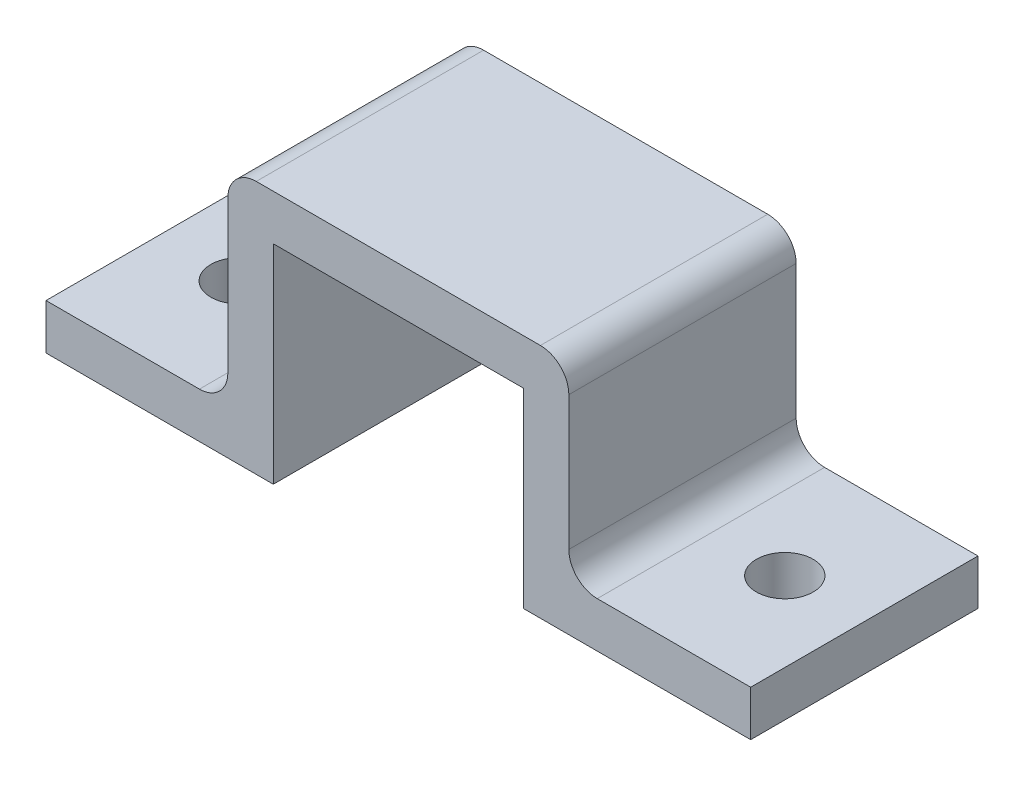
ISO-10303-21;
HEADER;
FILE_DESCRIPTION(('STEP AP214'),'2;1');
FILE_NAME('part.step','',(''),(''),'','','');
FILE_SCHEMA(('AUTOMOTIVE_DESIGN { 1 0 10303 214 1 1 1 1 }'));
ENDSEC;
DATA;
#1=APPLICATION_CONTEXT('core data for automotive mechanical design processes');
#2=APPLICATION_PROTOCOL_DEFINITION('international standard','automotive_design',2000,#1);
#3=PRODUCT_CONTEXT('',#1,'mechanical');
#4=PRODUCT('Part','Part','',(#3));
#5=PRODUCT_RELATED_PRODUCT_CATEGORY('part','',(#4));
#6=PRODUCT_DEFINITION_FORMATION('','',#4);
#7=PRODUCT_DEFINITION_CONTEXT('part definition',#1,'design');
#8=PRODUCT_DEFINITION('design','',#6,#7);
#9=PRODUCT_DEFINITION_SHAPE('','',#8);
#10=(LENGTH_UNIT() NAMED_UNIT(*) SI_UNIT(.MILLI.,.METRE.));
#11=(NAMED_UNIT(*) PLANE_ANGLE_UNIT() SI_UNIT($,.RADIAN.));
#12=(NAMED_UNIT(*) SI_UNIT($,.STERADIAN.) SOLID_ANGLE_UNIT());
#13=UNCERTAINTY_MEASURE_WITH_UNIT(LENGTH_MEASURE(1.E-05),#10,'distance_accuracy_value','');
#14=(GEOMETRIC_REPRESENTATION_CONTEXT(3) GLOBAL_UNCERTAINTY_ASSIGNED_CONTEXT((#13)) GLOBAL_UNIT_ASSIGNED_CONTEXT((#10,
#11,#12)) REPRESENTATION_CONTEXT('',''));
#15=CARTESIAN_POINT('',(0.,0.,0.));
#16=DIRECTION('',(0.,0.,1.));
#17=DIRECTION('',(1.,0.,0.));
#18=AXIS2_PLACEMENT_3D('',#15,#16,#17);
#19=CARTESIAN_POINT('',(0.,4.,20.));
#20=DIRECTION('',(1.,0.,0.));
#21=DIRECTION('',(0.,1.,0.));
#22=AXIS2_PLACEMENT_3D('',#19,#20,#21);
#23=PLANE('',#22);
#24=DIRECTION('',(0.,-1.,0.));
#25=VECTOR('',#24,1.);
#26=CARTESIAN_POINT('',(0.,4.,0.));
#27=LINE('',#26,#25);
#28=CARTESIAN_POINT('',(0.,4.,0.));
#29=VERTEX_POINT('',#28);
#30=CARTESIAN_POINT('',(0.,0.,0.));
#31=VERTEX_POINT('',#30);
#32=EDGE_CURVE('E168',#29,#31,#27,.T.);
#33=ORIENTED_EDGE('',*,*,#32,.T.);
#34=DIRECTION('',(0.,0.,-1.));
#35=VECTOR('',#34,1.);
#36=CARTESIAN_POINT('',(0.,0.,20.));
#37=LINE('',#36,#35);
#38=CARTESIAN_POINT('',(0.,0.,20.));
#39=VERTEX_POINT('',#38);
#40=EDGE_CURVE('E150',#39,#31,#37,.T.);
#41=ORIENTED_EDGE('',*,*,#40,.F.);
#42=DIRECTION('',(0.,-1.,0.));
#43=VECTOR('',#42,1.);
#44=CARTESIAN_POINT('',(0.,4.,20.));
#45=LINE('',#44,#43);
#46=CARTESIAN_POINT('',(0.,4.,20.));
#47=VERTEX_POINT('',#46);
#48=EDGE_CURVE('E156',#47,#39,#45,.T.);
#49=ORIENTED_EDGE('',*,*,#48,.F.);
#50=DIRECTION('',(0.,0.,-1.));
#51=VECTOR('',#50,1.);
#52=CARTESIAN_POINT('',(0.,4.,20.));
#53=LINE('',#52,#51);
#54=EDGE_CURVE('E218',#47,#29,#53,.T.);
#55=ORIENTED_EDGE('',*,*,#54,.T.);
#56=EDGE_LOOP('',(#33,#41,#49,#55));
#57=FACE_BOUND('',#56,.T.);
#58=ADVANCED_FACE('F33',(#57),#23,.F.);
#59=CARTESIAN_POINT('',(0.,0.,20.));
#60=DIRECTION('',(0.,1.,0.));
#61=DIRECTION('',(0.,0.,1.));
#62=AXIS2_PLACEMENT_3D('',#59,#60,#61);
#63=PLANE('',#62);
#64=CARTESIAN_POINT('',(7.,0.,10.));
#65=DIRECTION('',(0.,1.,0.));
#66=DIRECTION('',(0.,0.,1.));
#67=AXIS2_PLACEMENT_3D('',#64,#65,#66);
#68=CIRCLE('',#67,2.5);
#69=CARTESIAN_POINT('',(7.,0.,12.5));
#70=VERTEX_POINT('',#69);
#71=EDGE_CURVE('E229',#70,#70,#68,.T.);
#72=ORIENTED_EDGE('',*,*,#71,.T.);
#73=EDGE_LOOP('',(#72));
#74=FACE_BOUND('',#73,.T.);
#75=DIRECTION('',(1.,0.,0.));
#76=VECTOR('',#75,1.);
#77=CARTESIAN_POINT('',(0.,0.,0.));
#78=LINE('',#77,#76);
#79=CARTESIAN_POINT('',(20.,0.,0.));
#80=VERTEX_POINT('',#79);
#81=EDGE_CURVE('E228',#31,#80,#78,.T.);
#82=ORIENTED_EDGE('',*,*,#81,.T.);
#83=DIRECTION('',(0.,0.,-1.));
#84=VECTOR('',#83,1.);
#85=CARTESIAN_POINT('',(20.,0.,20.));
#86=LINE('',#85,#84);
#87=CARTESIAN_POINT('',(20.,0.,20.));
#88=VERTEX_POINT('',#87);
#89=EDGE_CURVE('E153',#88,#80,#86,.T.);
#90=ORIENTED_EDGE('',*,*,#89,.F.);
#91=DIRECTION('',(1.,0.,0.));
#92=VECTOR('',#91,1.);
#93=CARTESIAN_POINT('',(0.,0.,20.));
#94=LINE('',#93,#92);
#95=EDGE_CURVE('E146',#39,#88,#94,.T.);
#96=ORIENTED_EDGE('',*,*,#95,.F.);
#97=ORIENTED_EDGE('',*,*,#40,.T.);
#98=EDGE_LOOP('',(#82,#90,#96,#97));
#99=FACE_BOUND('',#98,.T.);
#100=ADVANCED_FACE('F148',(#74,#99),#63,.F.);
#101=CARTESIAN_POINT('',(20.,0.,20.));
#102=DIRECTION('',(-1.,0.,0.));
#103=DIRECTION('',(0.,0.,1.));
#104=AXIS2_PLACEMENT_3D('',#101,#102,#103);
#105=PLANE('',#104);
#106=DIRECTION('',(0.,1.,0.));
#107=VECTOR('',#106,1.);
#108=CARTESIAN_POINT('',(20.,0.,0.));
#109=LINE('',#108,#107);
#110=CARTESIAN_POINT('',(20.,18.325792173001,0.));
#111=VERTEX_POINT('',#110);
#112=EDGE_CURVE('E231',#80,#111,#109,.T.);
#113=ORIENTED_EDGE('',*,*,#112,.T.);
#114=DIRECTION('',(0.,0.,-1.));
#115=VECTOR('',#114,1.);
#116=CARTESIAN_POINT('',(20.,18.325792173001,20.));
#117=LINE('',#116,#115);
#118=CARTESIAN_POINT('',(20.,18.325792173001,20.));
#119=VERTEX_POINT('',#118);
#120=EDGE_CURVE('E173',#119,#111,#117,.T.);
#121=ORIENTED_EDGE('',*,*,#120,.F.);
#122=DIRECTION('',(0.,1.,0.));
#123=VECTOR('',#122,1.);
#124=CARTESIAN_POINT('',(20.,0.,20.));
#125=LINE('',#124,#123);
#126=EDGE_CURVE('E155',#88,#119,#125,.T.);
#127=ORIENTED_EDGE('',*,*,#126,.F.);
#128=ORIENTED_EDGE('',*,*,#89,.T.);
#129=EDGE_LOOP('',(#113,#121,#127,#128));
#130=FACE_BOUND('',#129,.T.);
#131=ADVANCED_FACE('F341',(#130),#105,.F.);
#132=CARTESIAN_POINT('',(20.,18.325792173001,20.));
#133=DIRECTION('',(0.,1.,0.));
#134=DIRECTION('',(0.,0.,1.));
#135=AXIS2_PLACEMENT_3D('',#132,#133,#134);
#136=PLANE('',#135);
#137=DIRECTION('',(1.,0.,0.));
#138=VECTOR('',#137,1.);
#139=CARTESIAN_POINT('',(20.,18.325792173001,0.));
#140=LINE('',#139,#138);
#141=CARTESIAN_POINT('',(42.,18.325792173001,0.));
#142=VERTEX_POINT('',#141);
#143=EDGE_CURVE('E233',#111,#142,#140,.T.);
#144=ORIENTED_EDGE('',*,*,#143,.T.);
#145=DIRECTION('',(0.,0.,-1.));
#146=VECTOR('',#145,1.);
#147=CARTESIAN_POINT('',(42.,18.325792173001,20.));
#148=LINE('',#147,#146);
#149=CARTESIAN_POINT('',(42.,18.325792173001,20.));
#150=VERTEX_POINT('',#149);
#151=EDGE_CURVE('E258',#150,#142,#148,.T.);
#152=ORIENTED_EDGE('',*,*,#151,.F.);
#153=DIRECTION('',(1.,0.,0.));
#154=VECTOR('',#153,1.);
#155=CARTESIAN_POINT('',(20.,18.325792173001,20.));
#156=LINE('',#155,#154);
#157=EDGE_CURVE('E267',#119,#150,#156,.T.);
#158=ORIENTED_EDGE('',*,*,#157,.F.);
#159=ORIENTED_EDGE('',*,*,#120,.T.);
#160=EDGE_LOOP('',(#144,#152,#158,#159));
#161=FACE_BOUND('',#160,.T.);
#162=ADVANCED_FACE('F265',(#161),#136,.F.);
#163=CARTESIAN_POINT('',(42.,18.325792173001,20.));
#164=DIRECTION('',(1.,0.,0.));
#165=DIRECTION('',(0.,1.,0.));
#166=AXIS2_PLACEMENT_3D('',#163,#164,#165);
#167=PLANE('',#166);
#168=DIRECTION('',(0.,-1.,0.));
#169=VECTOR('',#168,1.);
#170=CARTESIAN_POINT('',(42.,18.325792173001,0.));
#171=LINE('',#170,#169);
#172=CARTESIAN_POINT('',(42.,1.53631848879043,0.));
#173=VERTEX_POINT('',#172);
#174=EDGE_CURVE('E235',#142,#173,#171,.T.);
#175=ORIENTED_EDGE('',*,*,#174,.T.);
#176=DIRECTION('',(0.,0.,-1.));
#177=VECTOR('',#176,1.);
#178=CARTESIAN_POINT('',(42.,1.53631848879043,20.));
#179=LINE('',#178,#177);
#180=CARTESIAN_POINT('',(42.,1.53631848879043,20.));
#181=VERTEX_POINT('',#180);
#182=EDGE_CURVE('E255',#181,#173,#179,.T.);
#183=ORIENTED_EDGE('',*,*,#182,.F.);
#184=DIRECTION('',(0.,-1.,0.));
#185=VECTOR('',#184,1.);
#186=CARTESIAN_POINT('',(42.,18.325792173001,20.));
#187=LINE('',#186,#185);
#188=EDGE_CURVE('E284',#150,#181,#187,.T.);
#189=ORIENTED_EDGE('',*,*,#188,.F.);
#190=ORIENTED_EDGE('',*,*,#151,.T.);
#191=EDGE_LOOP('',(#175,#183,#189,#190));
#192=FACE_BOUND('',#191,.T.);
#193=ADVANCED_FACE('F275',(#192),#167,.F.);
#194=CARTESIAN_POINT('',(42.,1.53631848879043,20.));
#195=DIRECTION('',(0.,1.,0.));
#196=DIRECTION('',(-1.,0.,0.));
#197=AXIS2_PLACEMENT_3D('',#194,#195,#196);
#198=PLANE('',#197);
#199=CARTESIAN_POINT('',(55.,1.53631848879043,10.));
#200=DIRECTION('',(0.,1.,0.));
#201=DIRECTION('',(-1.,0.,0.));
#202=AXIS2_PLACEMENT_3D('',#199,#200,#201);
#203=CIRCLE('',#202,2.5);
#204=CARTESIAN_POINT('',(52.5,1.53631848879043,10.));
#205=VERTEX_POINT('',#204);
#206=EDGE_CURVE('E492',#205,#205,#203,.T.);
#207=ORIENTED_EDGE('',*,*,#206,.T.);
#208=EDGE_LOOP('',(#207));
#209=FACE_BOUND('',#208,.T.);
#210=DIRECTION('',(1.,0.,0.));
#211=VECTOR('',#210,1.);
#212=CARTESIAN_POINT('',(42.,1.53631848879043,0.));
#213=LINE('',#212,#211);
#214=CARTESIAN_POINT('',(62.,1.53631848879043,0.));
#215=VERTEX_POINT('',#214);
#216=EDGE_CURVE('E237',#173,#215,#213,.T.);
#217=ORIENTED_EDGE('',*,*,#216,.T.);
#218=DIRECTION('',(0.,0.,-1.));
#219=VECTOR('',#218,1.);
#220=CARTESIAN_POINT('',(62.,1.53631848879043,20.));
#221=LINE('',#220,#219);
#222=CARTESIAN_POINT('',(62.,1.53631848879043,20.));
#223=VERTEX_POINT('',#222);
#224=EDGE_CURVE('E252',#223,#215,#221,.T.);
#225=ORIENTED_EDGE('',*,*,#224,.F.);
#226=DIRECTION('',(1.,0.,0.));
#227=VECTOR('',#226,1.);
#228=CARTESIAN_POINT('',(42.,1.53631848879043,20.));
#229=LINE('',#228,#227);
#230=EDGE_CURVE('E281',#181,#223,#229,.T.);
#231=ORIENTED_EDGE('',*,*,#230,.F.);
#232=ORIENTED_EDGE('',*,*,#182,.T.);
#233=EDGE_LOOP('',(#217,#225,#231,#232));
#234=FACE_BOUND('',#233,.T.);
#235=ADVANCED_FACE('F279',(#209,#234),#198,.F.);
#236=CARTESIAN_POINT('',(62.,1.53631848879043,20.));
#237=DIRECTION('',(-1.,0.,0.));
#238=DIRECTION('',(0.,0.,1.));
#239=AXIS2_PLACEMENT_3D('',#236,#237,#238);
#240=PLANE('',#239);
#241=DIRECTION('',(0.,1.,0.));
#242=VECTOR('',#241,1.);
#243=CARTESIAN_POINT('',(62.,1.53631848879043,0.));
#244=LINE('',#243,#242);
#245=CARTESIAN_POINT('',(62.,5.53631848879043,0.));
#246=VERTEX_POINT('',#245);
#247=EDGE_CURVE('E239',#215,#246,#244,.T.);
#248=ORIENTED_EDGE('',*,*,#247,.T.);
#249=DIRECTION('',(0.,0.,-1.));
#250=VECTOR('',#249,1.);
#251=CARTESIAN_POINT('',(62.,5.53631848879043,20.));
#252=LINE('',#251,#250);
#253=CARTESIAN_POINT('',(62.,5.53631848879043,20.));
#254=VERTEX_POINT('',#253);
#255=EDGE_CURVE('E221',#254,#246,#252,.T.);
#256=ORIENTED_EDGE('',*,*,#255,.F.);
#257=DIRECTION('',(0.,1.,0.));
#258=VECTOR('',#257,1.);
#259=CARTESIAN_POINT('',(62.,1.53631848879043,20.));
#260=LINE('',#259,#258);
#261=EDGE_CURVE('E283',#223,#254,#260,.T.);
#262=ORIENTED_EDGE('',*,*,#261,.F.);
#263=ORIENTED_EDGE('',*,*,#224,.T.);
#264=EDGE_LOOP('',(#248,#256,#262,#263));
#265=FACE_BOUND('',#264,.T.);
#266=ADVANCED_FACE('F322',(#265),#240,.F.);
#267=CARTESIAN_POINT('',(62.,5.53631848879043,20.));
#268=DIRECTION('',(0.,-1.,0.));
#269=DIRECTION('',(1.,0.,0.));
#270=AXIS2_PLACEMENT_3D('',#267,#268,#269);
#271=PLANE('',#270);
#272=CARTESIAN_POINT('',(55.,5.53631848879043,10.));
#273=DIRECTION('',(0.,1.,0.));
#274=DIRECTION('',(-1.,0.,0.));
#275=AXIS2_PLACEMENT_3D('',#272,#273,#274);
#276=CIRCLE('',#275,2.5);
#277=CARTESIAN_POINT('',(52.5,5.53631848879043,10.));
#278=VERTEX_POINT('',#277);
#279=EDGE_CURVE('E495',#278,#278,#276,.T.);
#280=ORIENTED_EDGE('',*,*,#279,.F.);
#281=EDGE_LOOP('',(#280));
#282=FACE_BOUND('',#281,.T.);
#283=DIRECTION('',(-1.,0.,0.));
#284=VECTOR('',#283,1.);
#285=CARTESIAN_POINT('',(62.,5.53631848879043,0.));
#286=LINE('',#285,#284);
#287=CARTESIAN_POINT('',(48.5,5.53631848879042,0.));
#288=VERTEX_POINT('',#287);
#289=EDGE_CURVE('E241',#246,#288,#286,.T.);
#290=ORIENTED_EDGE('',*,*,#289,.T.);
#291=DIRECTION('',(0.,0.,-1.));
#292=VECTOR('',#291,1.);
#293=CARTESIAN_POINT('',(48.5,5.53631848879042,20.));
#294=LINE('',#293,#292);
#295=CARTESIAN_POINT('',(48.5,5.53631848879042,20.));
#296=VERTEX_POINT('',#295);
#297=EDGE_CURVE('E179',#288,#296,#294,.F.);
#298=ORIENTED_EDGE('',*,*,#297,.T.);
#299=DIRECTION('',(-1.,0.,0.));
#300=VECTOR('',#299,1.);
#301=CARTESIAN_POINT('',(62.,5.53631848879043,20.));
#302=LINE('',#301,#300);
#303=EDGE_CURVE('E286',#254,#296,#302,.T.);
#304=ORIENTED_EDGE('',*,*,#303,.F.);
#305=ORIENTED_EDGE('',*,*,#255,.T.);
#306=EDGE_LOOP('',(#290,#298,#304,#305));
#307=FACE_BOUND('',#306,.T.);
#308=ADVANCED_FACE('F318',(#282,#307),#271,.F.);
#309=CARTESIAN_POINT('',(46.,5.53631848879042,20.));
#310=DIRECTION('',(-1.,0.,0.));
#311=DIRECTION('',(0.,0.,1.));
#312=AXIS2_PLACEMENT_3D('',#309,#310,#311);
#313=PLANE('',#312);
#314=DIRECTION('',(0.,1.,0.));
#315=VECTOR('',#314,1.);
#316=CARTESIAN_POINT('',(46.,5.53631848879042,20.));
#317=LINE('',#316,#315);
#318=CARTESIAN_POINT('',(46.,8.03631848879042,20.));
#319=VERTEX_POINT('',#318);
#320=CARTESIAN_POINT('',(46.,19.825792173001,20.));
#321=VERTEX_POINT('',#320);
#322=EDGE_CURVE('E293',#319,#321,#317,.T.);
#323=ORIENTED_EDGE('',*,*,#322,.F.);
#324=DIRECTION('',(0.,0.,-1.));
#325=VECTOR('',#324,1.);
#326=CARTESIAN_POINT('',(46.,8.03631848879042,0.));
#327=LINE('',#326,#325);
#328=CARTESIAN_POINT('',(46.,8.03631848879042,0.));
#329=VERTEX_POINT('',#328);
#330=EDGE_CURVE('E171',#319,#329,#327,.T.);
#331=ORIENTED_EDGE('',*,*,#330,.T.);
#332=DIRECTION('',(0.,1.,0.));
#333=VECTOR('',#332,1.);
#334=CARTESIAN_POINT('',(46.,5.53631848879042,0.));
#335=LINE('',#334,#333);
#336=CARTESIAN_POINT('',(46.,19.825792173001,0.));
#337=VERTEX_POINT('',#336);
#338=EDGE_CURVE('E244',#329,#337,#335,.T.);
#339=ORIENTED_EDGE('',*,*,#338,.T.);
#340=DIRECTION('',(0.,0.,-1.));
#341=VECTOR('',#340,1.);
#342=CARTESIAN_POINT('',(46.,19.825792173001,20.));
#343=LINE('',#342,#341);
#344=EDGE_CURVE('E169',#337,#321,#343,.F.);
#345=ORIENTED_EDGE('',*,*,#344,.T.);
#346=EDGE_LOOP('',(#323,#331,#339,#345));
#347=FACE_BOUND('',#346,.T.);
#348=ADVANCED_FACE('F310',(#347),#313,.F.);
#349=CARTESIAN_POINT('',(16.,22.325792173001,20.));
#350=DIRECTION('',(0.,-1.,0.));
#351=DIRECTION('',(0.,0.,-1.));
#352=AXIS2_PLACEMENT_3D('',#349,#350,#351);
#353=PLANE('',#352);
#354=DIRECTION('',(-1.,0.,0.));
#355=VECTOR('',#354,1.);
#356=CARTESIAN_POINT('',(16.,22.325792173001,20.));
#357=LINE('',#356,#355);
#358=CARTESIAN_POINT('',(43.5,22.325792173001,20.));
#359=VERTEX_POINT('',#358);
#360=CARTESIAN_POINT('',(18.5,22.325792173001,20.));
#361=VERTEX_POINT('',#360);
#362=EDGE_CURVE('E223',#359,#361,#357,.T.);
#363=ORIENTED_EDGE('',*,*,#362,.F.);
#364=DIRECTION('',(0.,0.,-1.));
#365=VECTOR('',#364,1.);
#366=CARTESIAN_POINT('',(43.5,22.325792173001,20.));
#367=LINE('',#366,#365);
#368=CARTESIAN_POINT('',(43.5,22.325792173001,0.));
#369=VERTEX_POINT('',#368);
#370=EDGE_CURVE('E183',#359,#369,#367,.T.);
#371=ORIENTED_EDGE('',*,*,#370,.T.);
#372=DIRECTION('',(-1.,0.,0.));
#373=VECTOR('',#372,1.);
#374=CARTESIAN_POINT('',(16.,22.325792173001,0.));
#375=LINE('',#374,#373);
#376=CARTESIAN_POINT('',(18.5,22.325792173001,0.));
#377=VERTEX_POINT('',#376);
#378=EDGE_CURVE('E214',#369,#377,#375,.T.);
#379=ORIENTED_EDGE('',*,*,#378,.T.);
#380=DIRECTION('',(0.,0.,-1.));
#381=VECTOR('',#380,1.);
#382=CARTESIAN_POINT('',(18.5,22.325792173001,20.));
#383=LINE('',#382,#381);
#384=EDGE_CURVE('E181',#377,#361,#383,.F.);
#385=ORIENTED_EDGE('',*,*,#384,.T.);
#386=EDGE_LOOP('',(#363,#371,#379,#385));
#387=FACE_BOUND('',#386,.T.);
#388=ADVANCED_FACE('F303',(#387),#353,.F.);
#389=CARTESIAN_POINT('',(16.,22.325792173001,20.));
#390=DIRECTION('',(1.,0.,0.));
#391=DIRECTION('',(0.,0.,-1.));
#392=AXIS2_PLACEMENT_3D('',#389,#390,#391);
#393=PLANE('',#392);
#394=DIRECTION('',(0.,-1.,0.));
#395=VECTOR('',#394,1.);
#396=CARTESIAN_POINT('',(16.,22.325792173001,20.));
#397=LINE('',#396,#395);
#398=CARTESIAN_POINT('',(16.,19.825792173001,20.));
#399=VERTEX_POINT('',#398);
#400=CARTESIAN_POINT('',(16.,6.5,20.));
#401=VERTEX_POINT('',#400);
#402=EDGE_CURVE('E219',#399,#401,#397,.T.);
#403=ORIENTED_EDGE('',*,*,#402,.F.);
#404=DIRECTION('',(0.,0.,-1.));
#405=VECTOR('',#404,1.);
#406=CARTESIAN_POINT('',(16.,19.825792173001,20.));
#407=LINE('',#406,#405);
#408=CARTESIAN_POINT('',(16.,19.825792173001,0.));
#409=VERTEX_POINT('',#408);
#410=EDGE_CURVE('E195',#399,#409,#407,.T.);
#411=ORIENTED_EDGE('',*,*,#410,.T.);
#412=DIRECTION('',(0.,-1.,0.));
#413=VECTOR('',#412,1.);
#414=CARTESIAN_POINT('',(16.,22.325792173001,0.));
#415=LINE('',#414,#413);
#416=CARTESIAN_POINT('',(16.,6.5,0.));
#417=VERTEX_POINT('',#416);
#418=EDGE_CURVE('E209',#409,#417,#415,.T.);
#419=ORIENTED_EDGE('',*,*,#418,.T.);
#420=DIRECTION('',(0.,0.,-1.));
#421=VECTOR('',#420,1.);
#422=CARTESIAN_POINT('',(16.,6.5,20.));
#423=LINE('',#422,#421);
#424=EDGE_CURVE('E54',#417,#401,#423,.F.);
#425=ORIENTED_EDGE('',*,*,#424,.T.);
#426=EDGE_LOOP('',(#403,#411,#419,#425));
#427=FACE_BOUND('',#426,.T.);
#428=ADVANCED_FACE('F212',(#427),#393,.F.);
#429=CARTESIAN_POINT('',(16.,4.,20.));
#430=DIRECTION('',(0.,-1.,0.));
#431=DIRECTION('',(1.,0.,0.));
#432=AXIS2_PLACEMENT_3D('',#429,#430,#431);
#433=PLANE('',#432);
#434=CARTESIAN_POINT('',(7.,4.,10.));
#435=DIRECTION('',(0.,1.,0.));
#436=DIRECTION('',(-1.,0.,0.));
#437=AXIS2_PLACEMENT_3D('',#434,#435,#436);
#438=CIRCLE('',#437,2.5);
#439=CARTESIAN_POINT('',(4.5,4.,10.));
#440=VERTEX_POINT('',#439);
#441=EDGE_CURVE('E490',#440,#440,#438,.T.);
#442=ORIENTED_EDGE('',*,*,#441,.F.);
#443=EDGE_LOOP('',(#442));
#444=FACE_BOUND('',#443,.T.);
#445=DIRECTION('',(-1.,0.,0.));
#446=VECTOR('',#445,1.);
#447=CARTESIAN_POINT('',(16.,4.,20.));
#448=LINE('',#447,#446);
#449=CARTESIAN_POINT('',(13.5,4.,20.));
#450=VERTEX_POINT('',#449);
#451=EDGE_CURVE('E161',#450,#47,#448,.T.);
#452=ORIENTED_EDGE('',*,*,#451,.F.);
#453=DIRECTION('',(0.,0.,-1.));
#454=VECTOR('',#453,1.);
#455=CARTESIAN_POINT('',(13.5,4.,0.));
#456=LINE('',#455,#454);
#457=CARTESIAN_POINT('',(13.5,4.,0.));
#458=VERTEX_POINT('',#457);
#459=EDGE_CURVE('E198',#450,#458,#456,.T.);
#460=ORIENTED_EDGE('',*,*,#459,.T.);
#461=DIRECTION('',(-1.,0.,0.));
#462=VECTOR('',#461,1.);
#463=CARTESIAN_POINT('',(16.,4.,0.));
#464=LINE('',#463,#462);
#465=EDGE_CURVE('E165',#458,#29,#464,.T.);
#466=ORIENTED_EDGE('',*,*,#465,.T.);
#467=ORIENTED_EDGE('',*,*,#54,.F.);
#468=EDGE_LOOP('',(#452,#460,#466,#467));
#469=FACE_BOUND('',#468,.T.);
#470=ADVANCED_FACE('F217',(#444,#469),#433,.F.);
#471=CARTESIAN_POINT('',(0.,0.,20.));
#472=DIRECTION('',(0.,0.,1.));
#473=DIRECTION('',(1.,0.,0.));
#474=AXIS2_PLACEMENT_3D('',#471,#472,#473);
#475=PLANE('',#474);
#476=ORIENTED_EDGE('',*,*,#322,.T.);
#477=CARTESIAN_POINT('',(43.5,19.825792173001,20.));
#478=DIRECTION('',(0.,0.,1.));
#479=DIRECTION('',(1.,0.,0.));
#480=AXIS2_PLACEMENT_3D('',#477,#478,#479);
#481=CIRCLE('',#480,2.5);
#482=EDGE_CURVE('E192',#321,#359,#481,.T.);
#483=ORIENTED_EDGE('',*,*,#482,.T.);
#484=ORIENTED_EDGE('',*,*,#362,.T.);
#485=CARTESIAN_POINT('',(18.5,19.825792173001,20.));
#486=DIRECTION('',(0.,0.,1.));
#487=DIRECTION('',(1.,0.,0.));
#488=AXIS2_PLACEMENT_3D('',#485,#486,#487);
#489=CIRCLE('',#488,2.5);
#490=EDGE_CURVE('E190',#361,#399,#489,.T.);
#491=ORIENTED_EDGE('',*,*,#490,.T.);
#492=ORIENTED_EDGE('',*,*,#402,.T.);
#493=CARTESIAN_POINT('',(13.5,6.5,20.));
#494=DIRECTION('',(0.,0.,1.));
#495=DIRECTION('',(1.,0.,0.));
#496=AXIS2_PLACEMENT_3D('',#493,#494,#495);
#497=CIRCLE('',#496,2.5);
#498=EDGE_CURVE('E11',#401,#450,#497,.F.);
#499=ORIENTED_EDGE('',*,*,#498,.T.);
#500=ORIENTED_EDGE('',*,*,#451,.T.);
#501=ORIENTED_EDGE('',*,*,#48,.T.);
#502=ORIENTED_EDGE('',*,*,#95,.T.);
#503=ORIENTED_EDGE('',*,*,#126,.T.);
#504=ORIENTED_EDGE('',*,*,#157,.T.);
#505=ORIENTED_EDGE('',*,*,#188,.T.);
#506=ORIENTED_EDGE('',*,*,#230,.T.);
#507=ORIENTED_EDGE('',*,*,#261,.T.);
#508=ORIENTED_EDGE('',*,*,#303,.T.);
#509=CARTESIAN_POINT('',(48.5,8.03631848879042,20.));
#510=DIRECTION('',(0.,0.,1.));
#511=DIRECTION('',(1.,0.,0.));
#512=AXIS2_PLACEMENT_3D('',#509,#510,#511);
#513=CIRCLE('',#512,2.5);
#514=EDGE_CURVE('E203',#296,#319,#513,.F.);
#515=ORIENTED_EDGE('',*,*,#514,.T.);
#516=EDGE_LOOP('',(#476,#483,#484,#491,#492,#499,#500,#501,#502,#503,#504,#505,#506,#507,#508,#515));
#517=FACE_BOUND('',#516,.T.);
#518=ADVANCED_FACE('F160',(#517),#475,.T.);
#519=CARTESIAN_POINT('',(0.,0.,0.));
#520=DIRECTION('',(0.,0.,1.));
#521=DIRECTION('',(1.,0.,0.));
#522=AXIS2_PLACEMENT_3D('',#519,#520,#521);
#523=PLANE('',#522);
#524=ORIENTED_EDGE('',*,*,#378,.F.);
#525=CARTESIAN_POINT('',(43.5,19.825792173001,0.));
#526=DIRECTION('',(0.,0.,1.));
#527=DIRECTION('',(1.,0.,0.));
#528=AXIS2_PLACEMENT_3D('',#525,#526,#527);
#529=CIRCLE('',#528,2.5);
#530=EDGE_CURVE('E188',#369,#337,#529,.F.);
#531=ORIENTED_EDGE('',*,*,#530,.T.);
#532=ORIENTED_EDGE('',*,*,#338,.F.);
#533=CARTESIAN_POINT('',(48.5,8.03631848879042,0.));
#534=DIRECTION('',(0.,0.,1.));
#535=DIRECTION('',(1.,0.,0.));
#536=AXIS2_PLACEMENT_3D('',#533,#534,#535);
#537=CIRCLE('',#536,2.5);
#538=EDGE_CURVE('E201',#329,#288,#537,.T.);
#539=ORIENTED_EDGE('',*,*,#538,.T.);
#540=ORIENTED_EDGE('',*,*,#289,.F.);
#541=ORIENTED_EDGE('',*,*,#247,.F.);
#542=ORIENTED_EDGE('',*,*,#216,.F.);
#543=ORIENTED_EDGE('',*,*,#174,.F.);
#544=ORIENTED_EDGE('',*,*,#143,.F.);
#545=ORIENTED_EDGE('',*,*,#112,.F.);
#546=ORIENTED_EDGE('',*,*,#81,.F.);
#547=ORIENTED_EDGE('',*,*,#32,.F.);
#548=ORIENTED_EDGE('',*,*,#465,.F.);
#549=CARTESIAN_POINT('',(13.5,6.5,0.));
#550=DIRECTION('',(0.,0.,1.));
#551=DIRECTION('',(1.,0.,0.));
#552=AXIS2_PLACEMENT_3D('',#549,#550,#551);
#553=CIRCLE('',#552,2.5);
#554=EDGE_CURVE('E41',#458,#417,#553,.T.);
#555=ORIENTED_EDGE('',*,*,#554,.T.);
#556=ORIENTED_EDGE('',*,*,#418,.F.);
#557=CARTESIAN_POINT('',(18.5,19.825792173001,0.));
#558=DIRECTION('',(0.,0.,1.));
#559=DIRECTION('',(1.,0.,0.));
#560=AXIS2_PLACEMENT_3D('',#557,#558,#559);
#561=CIRCLE('',#560,2.5);
#562=EDGE_CURVE('E186',#409,#377,#561,.F.);
#563=ORIENTED_EDGE('',*,*,#562,.T.);
#564=EDGE_LOOP('',(#524,#531,#532,#539,#540,#541,#542,#543,#544,#545,#546,#547,#548,#555,#556,#563));
#565=FACE_BOUND('',#564,.T.);
#566=ADVANCED_FACE('F208',(#565),#523,.F.);
#567=CARTESIAN_POINT('',(48.5,8.03631848879042,20.));
#568=DIRECTION('',(0.,0.,1.));
#569=DIRECTION('',(1.,0.,0.));
#570=AXIS2_PLACEMENT_3D('',#567,#568,#569);
#571=CYLINDRICAL_SURFACE('',#570,2.5);
#572=ORIENTED_EDGE('',*,*,#514,.F.);
#573=ORIENTED_EDGE('',*,*,#297,.F.);
#574=ORIENTED_EDGE('',*,*,#538,.F.);
#575=ORIENTED_EDGE('',*,*,#330,.F.);
#576=EDGE_LOOP('',(#572,#573,#574,#575));
#577=FACE_BOUND('',#576,.T.);
#578=ADVANCED_FACE('F314',(#577),#571,.F.);
#579=CARTESIAN_POINT('',(43.5,19.825792173001,20.));
#580=DIRECTION('',(0.,0.,-1.));
#581=DIRECTION('',(-1.,0.,0.));
#582=AXIS2_PLACEMENT_3D('',#579,#580,#581);
#583=CYLINDRICAL_SURFACE('',#582,2.5);
#584=ORIENTED_EDGE('',*,*,#482,.F.);
#585=ORIENTED_EDGE('',*,*,#344,.F.);
#586=ORIENTED_EDGE('',*,*,#530,.F.);
#587=ORIENTED_EDGE('',*,*,#370,.F.);
#588=EDGE_LOOP('',(#584,#585,#586,#587));
#589=FACE_BOUND('',#588,.T.);
#590=ADVANCED_FACE('F305',(#589),#583,.T.);
#591=CARTESIAN_POINT('',(18.5,19.825792173001,20.));
#592=DIRECTION('',(0.,0.,-1.));
#593=DIRECTION('',(-1.,0.,0.));
#594=AXIS2_PLACEMENT_3D('',#591,#592,#593);
#595=CYLINDRICAL_SURFACE('',#594,2.5);
#596=ORIENTED_EDGE('',*,*,#490,.F.);
#597=ORIENTED_EDGE('',*,*,#384,.F.);
#598=ORIENTED_EDGE('',*,*,#562,.F.);
#599=ORIENTED_EDGE('',*,*,#410,.F.);
#600=EDGE_LOOP('',(#596,#597,#598,#599));
#601=FACE_BOUND('',#600,.T.);
#602=ADVANCED_FACE('F302',(#601),#595,.T.);
#603=CARTESIAN_POINT('',(13.5,6.5,20.));
#604=DIRECTION('',(0.,0.,1.));
#605=DIRECTION('',(1.,0.,0.));
#606=AXIS2_PLACEMENT_3D('',#603,#604,#605);
#607=CYLINDRICAL_SURFACE('',#606,2.5);
#608=ORIENTED_EDGE('',*,*,#498,.F.);
#609=ORIENTED_EDGE('',*,*,#424,.F.);
#610=ORIENTED_EDGE('',*,*,#554,.F.);
#611=ORIENTED_EDGE('',*,*,#459,.F.);
#612=EDGE_LOOP('',(#608,#609,#610,#611));
#613=FACE_BOUND('',#612,.T.);
#614=ADVANCED_FACE('F35',(#613),#607,.F.);
#615=CARTESIAN_POINT('',(7.,-6.,10.));
#616=DIRECTION('',(0.,1.,0.));
#617=DIRECTION('',(-1.,0.,0.));
#618=AXIS2_PLACEMENT_3D('',#615,#616,#617);
#619=CYLINDRICAL_SURFACE('',#618,2.5);
#620=ORIENTED_EDGE('',*,*,#441,.T.);
#621=EDGE_LOOP('',(#620));
#622=FACE_BOUND('',#621,.T.);
#623=ORIENTED_EDGE('',*,*,#71,.F.);
#624=EDGE_LOOP('',(#623));
#625=FACE_BOUND('',#624,.T.);
#626=ADVANCED_FACE('F353',(#622,#625),#619,.F.);
#627=CARTESIAN_POINT('',(55.,-4.46368151120957,10.));
#628=DIRECTION('',(0.,1.,0.));
#629=DIRECTION('',(-1.,0.,0.));
#630=AXIS2_PLACEMENT_3D('',#627,#628,#629);
#631=CYLINDRICAL_SURFACE('',#630,2.5);
#632=ORIENTED_EDGE('',*,*,#279,.T.);
#633=EDGE_LOOP('',(#632));
#634=FACE_BOUND('',#633,.T.);
#635=ORIENTED_EDGE('',*,*,#206,.F.);
#636=EDGE_LOOP('',(#635));
#637=FACE_BOUND('',#636,.T.);
#638=ADVANCED_FACE('F357',(#634,#637),#631,.F.);
#639=CLOSED_SHELL('',(#58,#100,#131,#162,#193,#235,#266,#308,#348,#388,#428,#470,#518,#566,#578,
#590,#602,#614,#626,#638));
#640=MANIFOLD_SOLID_BREP('B2',#639);
#641=ADVANCED_BREP_SHAPE_REPRESENTATION('',(#18,#640),#14);
#642=SHAPE_DEFINITION_REPRESENTATION(#9,#641);
ENDSEC;
END-ISO-10303-21;
